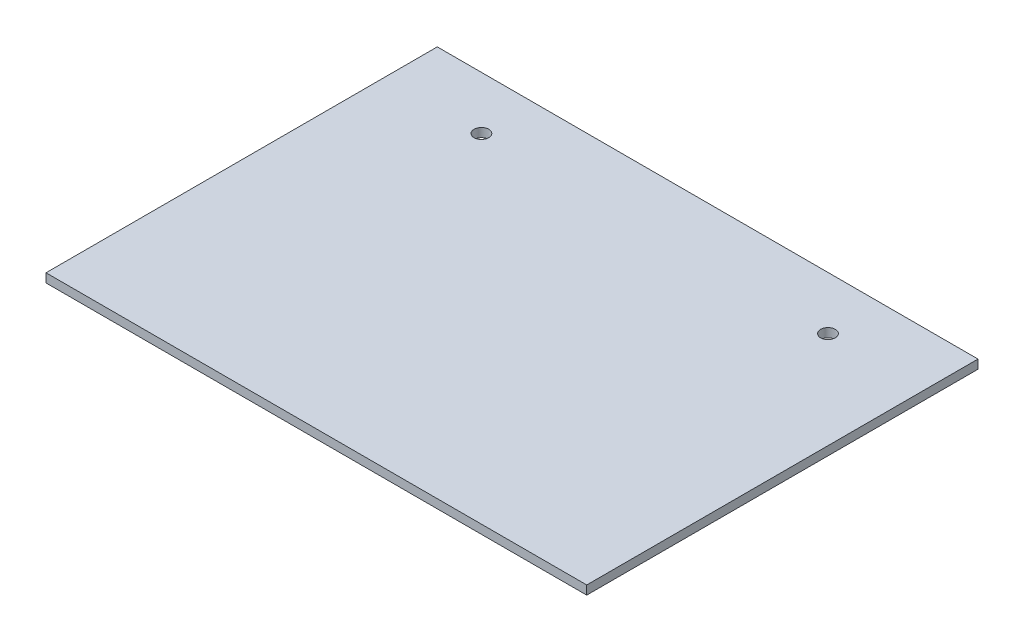
ISO-10303-21;
HEADER;
FILE_DESCRIPTION(('STEP AP214'),'2;1');
FILE_NAME('part.step','',(''),(''),'','','');
FILE_SCHEMA(('AUTOMOTIVE_DESIGN { 1 0 10303 214 1 1 1 1 }'));
ENDSEC;
DATA;
#1=APPLICATION_CONTEXT('core data for automotive mechanical design processes');
#2=APPLICATION_PROTOCOL_DEFINITION('international standard','automotive_design',2000,#1);
#3=PRODUCT_CONTEXT('',#1,'mechanical');
#4=PRODUCT('Part','Part','',(#3));
#5=PRODUCT_RELATED_PRODUCT_CATEGORY('part','',(#4));
#6=PRODUCT_DEFINITION_FORMATION('','',#4);
#7=PRODUCT_DEFINITION_CONTEXT('part definition',#1,'design');
#8=PRODUCT_DEFINITION('design','',#6,#7);
#9=PRODUCT_DEFINITION_SHAPE('','',#8);
#10=(LENGTH_UNIT() NAMED_UNIT(*) SI_UNIT(.MILLI.,.METRE.));
#11=(NAMED_UNIT(*) PLANE_ANGLE_UNIT() SI_UNIT($,.RADIAN.));
#12=(NAMED_UNIT(*) SI_UNIT($,.STERADIAN.) SOLID_ANGLE_UNIT());
#13=UNCERTAINTY_MEASURE_WITH_UNIT(LENGTH_MEASURE(1.E-05),#10,'distance_accuracy_value','');
#14=(GEOMETRIC_REPRESENTATION_CONTEXT(3) GLOBAL_UNCERTAINTY_ASSIGNED_CONTEXT((#13)) GLOBAL_UNIT_ASSIGNED_CONTEXT((#10,
#11,#12)) REPRESENTATION_CONTEXT('',''));
#15=CARTESIAN_POINT('',(0.,0.,0.));
#16=DIRECTION('',(0.,0.,1.));
#17=DIRECTION('',(1.,0.,0.));
#18=AXIS2_PLACEMENT_3D('',#15,#16,#17);
#19=CARTESIAN_POINT('',(0.,3.,3.));
#20=DIRECTION('',(0.,0.,1.));
#21=DIRECTION('',(1.,0.,0.));
#22=AXIS2_PLACEMENT_3D('',#19,#20,#21);
#23=PLANE('',#22);
#24=DIRECTION('',(-1.,0.,0.));
#25=VECTOR('',#24,1.);
#26=CARTESIAN_POINT('',(0.,0.,3.));
#27=LINE('',#26,#25);
#28=CARTESIAN_POINT('',(3.,0.,3.));
#29=VERTEX_POINT('',#28);
#30=CARTESIAN_POINT('',(-180.8,0.,3.));
#31=VERTEX_POINT('',#30);
#32=EDGE_CURVE('E106',#29,#31,#27,.T.);
#33=ORIENTED_EDGE('',*,*,#32,.F.);
#34=DIRECTION('',(0.,-1.,0.));
#35=VECTOR('',#34,1.);
#36=CARTESIAN_POINT('',(3.,3.,3.));
#37=LINE('',#36,#35);
#38=CARTESIAN_POINT('',(3.,3.,3.));
#39=VERTEX_POINT('',#38);
#40=EDGE_CURVE('E11',#39,#29,#37,.T.);
#41=ORIENTED_EDGE('',*,*,#40,.F.);
#42=DIRECTION('',(-1.,0.,0.));
#43=VECTOR('',#42,1.);
#44=CARTESIAN_POINT('',(0.,3.,3.));
#45=LINE('',#44,#43);
#46=CARTESIAN_POINT('',(-180.8,3.,3.));
#47=VERTEX_POINT('',#46);
#48=EDGE_CURVE('E90',#39,#47,#45,.T.);
#49=ORIENTED_EDGE('',*,*,#48,.T.);
#50=DIRECTION('',(0.,-1.,0.));
#51=VECTOR('',#50,1.);
#52=CARTESIAN_POINT('',(-180.8,3.,3.));
#53=LINE('',#52,#51);
#54=EDGE_CURVE('E52',#47,#31,#53,.T.);
#55=ORIENTED_EDGE('',*,*,#54,.T.);
#56=EDGE_LOOP('',(#33,#41,#49,#55));
#57=FACE_BOUND('',#56,.T.);
#58=ADVANCED_FACE('F35',(#57),#23,.T.);
#59=CARTESIAN_POINT('',(3.,3.,0.));
#60=DIRECTION('',(-1.,0.,0.));
#61=DIRECTION('',(0.,0.,1.));
#62=AXIS2_PLACEMENT_3D('',#59,#60,#61);
#63=PLANE('',#62);
#64=DIRECTION('',(0.,0.,-1.));
#65=VECTOR('',#64,1.);
#66=CARTESIAN_POINT('',(3.,0.,0.));
#67=LINE('',#66,#65);
#68=CARTESIAN_POINT('',(3.,0.,-130.));
#69=VERTEX_POINT('',#68);
#70=EDGE_CURVE('E95',#29,#69,#67,.T.);
#71=ORIENTED_EDGE('',*,*,#70,.T.);
#72=DIRECTION('',(0.,-1.,0.));
#73=VECTOR('',#72,1.);
#74=CARTESIAN_POINT('',(3.,3.,-130.));
#75=LINE('',#74,#73);
#76=CARTESIAN_POINT('',(3.,3.,-130.));
#77=VERTEX_POINT('',#76);
#78=EDGE_CURVE('E44',#77,#69,#75,.T.);
#79=ORIENTED_EDGE('',*,*,#78,.F.);
#80=DIRECTION('',(0.,0.,-1.));
#81=VECTOR('',#80,1.);
#82=CARTESIAN_POINT('',(3.,3.,0.));
#83=LINE('',#82,#81);
#84=EDGE_CURVE('E86',#39,#77,#83,.T.);
#85=ORIENTED_EDGE('',*,*,#84,.F.);
#86=ORIENTED_EDGE('',*,*,#40,.T.);
#87=EDGE_LOOP('',(#71,#79,#85,#86));
#88=FACE_BOUND('',#87,.T.);
#89=ADVANCED_FACE('F93',(#88),#63,.F.);
#90=CARTESIAN_POINT('',(0.,3.,-130.));
#91=DIRECTION('',(0.,0.,1.));
#92=DIRECTION('',(1.,0.,0.));
#93=AXIS2_PLACEMENT_3D('',#90,#91,#92);
#94=PLANE('',#93);
#95=DIRECTION('',(-1.,0.,0.));
#96=VECTOR('',#95,1.);
#97=CARTESIAN_POINT('',(0.,0.,-130.));
#98=LINE('',#97,#96);
#99=CARTESIAN_POINT('',(-180.8,0.,-130.));
#100=VERTEX_POINT('',#99);
#101=EDGE_CURVE('E103',#69,#100,#98,.T.);
#102=ORIENTED_EDGE('',*,*,#101,.T.);
#103=DIRECTION('',(0.,-1.,0.));
#104=VECTOR('',#103,1.);
#105=CARTESIAN_POINT('',(-180.8,3.,-130.));
#106=LINE('',#105,#104);
#107=CARTESIAN_POINT('',(-180.8,3.,-130.));
#108=VERTEX_POINT('',#107);
#109=EDGE_CURVE('E66',#108,#100,#106,.T.);
#110=ORIENTED_EDGE('',*,*,#109,.F.);
#111=DIRECTION('',(-1.,0.,0.));
#112=VECTOR('',#111,1.);
#113=CARTESIAN_POINT('',(0.,3.,-130.));
#114=LINE('',#113,#112);
#115=EDGE_CURVE('E78',#77,#108,#114,.T.);
#116=ORIENTED_EDGE('',*,*,#115,.F.);
#117=ORIENTED_EDGE('',*,*,#78,.T.);
#118=EDGE_LOOP('',(#102,#110,#116,#117));
#119=FACE_BOUND('',#118,.T.);
#120=ADVANCED_FACE('F80',(#119),#94,.F.);
#121=CARTESIAN_POINT('',(-147.8,3.,-112.));
#122=DIRECTION('',(0.,-1.,0.));
#123=DIRECTION('',(0.,0.,-1.));
#124=AXIS2_PLACEMENT_3D('',#121,#122,#123);
#125=CYLINDRICAL_SURFACE('',#124,2.5);
#126=CARTESIAN_POINT('',(-147.8,3.,-112.));
#127=DIRECTION('',(0.,1.,0.));
#128=DIRECTION('',(0.,0.,1.));
#129=AXIS2_PLACEMENT_3D('',#126,#127,#128);
#130=CIRCLE('',#129,2.5);
#131=CARTESIAN_POINT('',(-147.8,3.,-109.5));
#132=VERTEX_POINT('',#131);
#133=EDGE_CURVE('E116',#132,#132,#130,.T.);
#134=ORIENTED_EDGE('',*,*,#133,.T.);
#135=EDGE_LOOP('',(#134));
#136=FACE_BOUND('',#135,.T.);
#137=CARTESIAN_POINT('',(-147.8,0.,-112.));
#138=DIRECTION('',(0.,1.,0.));
#139=DIRECTION('',(0.,0.,1.));
#140=AXIS2_PLACEMENT_3D('',#137,#138,#139);
#141=CIRCLE('',#140,2.5);
#142=CARTESIAN_POINT('',(-147.8,0.,-109.5));
#143=VERTEX_POINT('',#142);
#144=EDGE_CURVE('E108',#143,#143,#141,.T.);
#145=ORIENTED_EDGE('',*,*,#144,.F.);
#146=EDGE_LOOP('',(#145));
#147=FACE_BOUND('',#146,.T.);
#148=ADVANCED_FACE('F131',(#136,#147),#125,.F.);
#149=CARTESIAN_POINT('',(-30.,3.,-112.));
#150=DIRECTION('',(0.,-1.,0.));
#151=DIRECTION('',(0.,0.,-1.));
#152=AXIS2_PLACEMENT_3D('',#149,#150,#151);
#153=CYLINDRICAL_SURFACE('',#152,2.5);
#154=CARTESIAN_POINT('',(-30.,3.,-112.));
#155=DIRECTION('',(0.,1.,0.));
#156=DIRECTION('',(0.,0.,1.));
#157=AXIS2_PLACEMENT_3D('',#154,#155,#156);
#158=CIRCLE('',#157,2.5);
#159=CARTESIAN_POINT('',(-30.,3.,-109.5));
#160=VERTEX_POINT('',#159);
#161=EDGE_CURVE('E102',#160,#160,#158,.T.);
#162=ORIENTED_EDGE('',*,*,#161,.T.);
#163=EDGE_LOOP('',(#162));
#164=FACE_BOUND('',#163,.T.);
#165=CARTESIAN_POINT('',(-30.,0.,-112.));
#166=DIRECTION('',(0.,1.,0.));
#167=DIRECTION('',(0.,0.,1.));
#168=AXIS2_PLACEMENT_3D('',#165,#166,#167);
#169=CIRCLE('',#168,2.5);
#170=CARTESIAN_POINT('',(-30.,0.,-109.5));
#171=VERTEX_POINT('',#170);
#172=EDGE_CURVE('E111',#171,#171,#169,.T.);
#173=ORIENTED_EDGE('',*,*,#172,.F.);
#174=EDGE_LOOP('',(#173));
#175=FACE_BOUND('',#174,.T.);
#176=ADVANCED_FACE('F37',(#164,#175),#153,.F.);
#177=CARTESIAN_POINT('',(-180.8,3.,0.));
#178=DIRECTION('',(-1.,0.,0.));
#179=DIRECTION('',(0.,0.,1.));
#180=AXIS2_PLACEMENT_3D('',#177,#178,#179);
#181=PLANE('',#180);
#182=DIRECTION('',(0.,0.,-1.));
#183=VECTOR('',#182,1.);
#184=CARTESIAN_POINT('',(-180.8,0.,0.));
#185=LINE('',#184,#183);
#186=EDGE_CURVE('E99',#31,#100,#185,.T.);
#187=ORIENTED_EDGE('',*,*,#186,.F.);
#188=ORIENTED_EDGE('',*,*,#54,.F.);
#189=DIRECTION('',(0.,0.,-1.));
#190=VECTOR('',#189,1.);
#191=CARTESIAN_POINT('',(-180.8,3.,0.));
#192=LINE('',#191,#190);
#193=EDGE_CURVE('E85',#47,#108,#192,.T.);
#194=ORIENTED_EDGE('',*,*,#193,.T.);
#195=ORIENTED_EDGE('',*,*,#109,.T.);
#196=EDGE_LOOP('',(#187,#188,#194,#195));
#197=FACE_BOUND('',#196,.T.);
#198=ADVANCED_FACE('F127',(#197),#181,.T.);
#199=CARTESIAN_POINT('',(0.,3.,0.));
#200=DIRECTION('',(0.,1.,0.));
#201=DIRECTION('',(0.,0.,1.));
#202=AXIS2_PLACEMENT_3D('',#199,#200,#201);
#203=PLANE('',#202);
#204=ORIENTED_EDGE('',*,*,#161,.F.);
#205=EDGE_LOOP('',(#204));
#206=FACE_BOUND('',#205,.T.);
#207=ORIENTED_EDGE('',*,*,#133,.F.);
#208=EDGE_LOOP('',(#207));
#209=FACE_BOUND('',#208,.T.);
#210=ORIENTED_EDGE('',*,*,#48,.F.);
#211=ORIENTED_EDGE('',*,*,#84,.T.);
#212=ORIENTED_EDGE('',*,*,#115,.T.);
#213=ORIENTED_EDGE('',*,*,#193,.F.);
#214=EDGE_LOOP('',(#210,#211,#212,#213));
#215=FACE_BOUND('',#214,.T.);
#216=ADVANCED_FACE('F89',(#206,#209,#215),#203,.T.);
#217=CARTESIAN_POINT('',(0.,0.,0.));
#218=DIRECTION('',(0.,1.,0.));
#219=DIRECTION('',(0.,0.,1.));
#220=AXIS2_PLACEMENT_3D('',#217,#218,#219);
#221=PLANE('',#220);
#222=ORIENTED_EDGE('',*,*,#172,.T.);
#223=EDGE_LOOP('',(#222));
#224=FACE_BOUND('',#223,.T.);
#225=ORIENTED_EDGE('',*,*,#144,.T.);
#226=EDGE_LOOP('',(#225));
#227=FACE_BOUND('',#226,.T.);
#228=ORIENTED_EDGE('',*,*,#32,.T.);
#229=ORIENTED_EDGE('',*,*,#186,.T.);
#230=ORIENTED_EDGE('',*,*,#101,.F.);
#231=ORIENTED_EDGE('',*,*,#70,.F.);
#232=EDGE_LOOP('',(#228,#229,#230,#231));
#233=FACE_BOUND('',#232,.T.);
#234=ADVANCED_FACE('F126',(#224,#227,#233),#221,.F.);
#235=CLOSED_SHELL('',(#58,#89,#120,#148,#176,#198,#216,#234));
#236=MANIFOLD_SOLID_BREP('B2',#235);
#237=ADVANCED_BREP_SHAPE_REPRESENTATION('',(#18,#236),#14);
#238=SHAPE_DEFINITION_REPRESENTATION(#9,#237);
ENDSEC;
END-ISO-10303-21;
